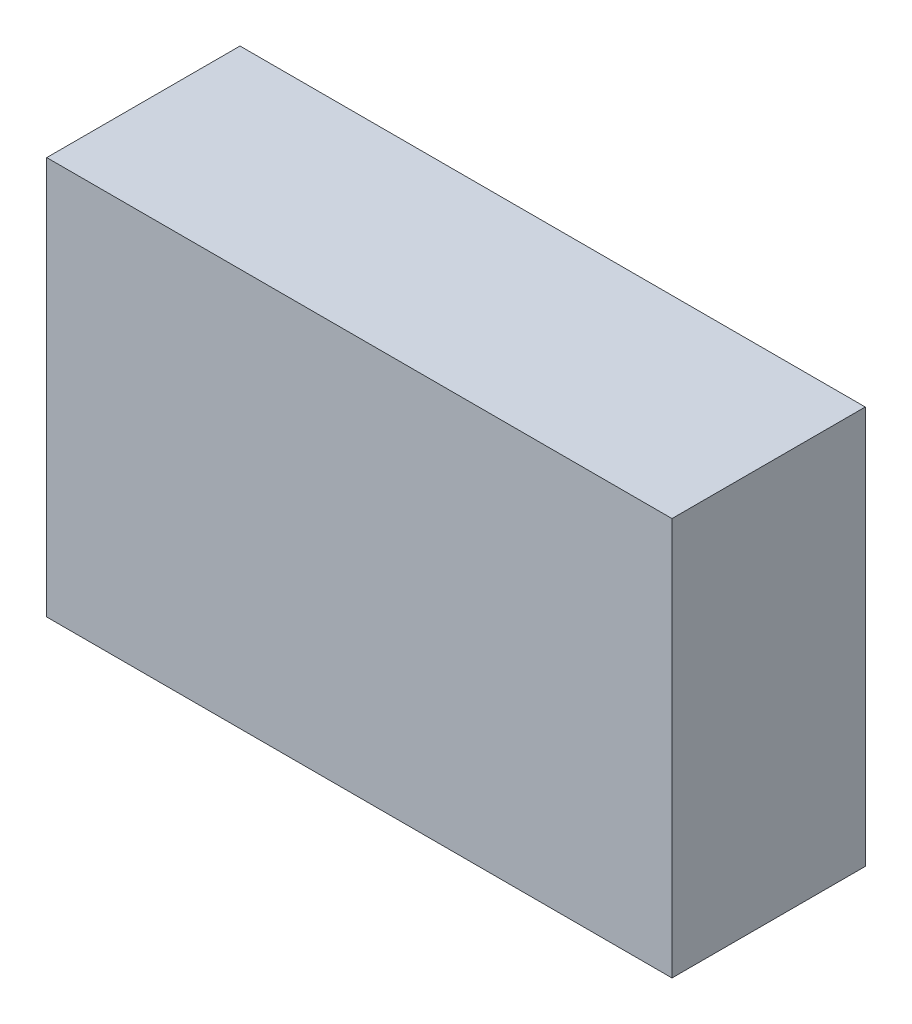
ISO-10303-21;
HEADER;
FILE_DESCRIPTION(('STEP AP214'),'2;1');
FILE_NAME('part.step','',(''),(''),'','','');
FILE_SCHEMA(('AUTOMOTIVE_DESIGN { 1 0 10303 214 1 1 1 1 }'));
ENDSEC;
DATA;
#1=APPLICATION_CONTEXT('core data for automotive mechanical design processes');
#2=APPLICATION_PROTOCOL_DEFINITION('international standard','automotive_design',2000,#1);
#3=PRODUCT_CONTEXT('',#1,'mechanical');
#4=PRODUCT('Part','Part','',(#3));
#5=PRODUCT_RELATED_PRODUCT_CATEGORY('part','',(#4));
#6=PRODUCT_DEFINITION_FORMATION('','',#4);
#7=PRODUCT_DEFINITION_CONTEXT('part definition',#1,'design');
#8=PRODUCT_DEFINITION('design','',#6,#7);
#9=PRODUCT_DEFINITION_SHAPE('','',#8);
#10=(LENGTH_UNIT() NAMED_UNIT(*) SI_UNIT(.MILLI.,.METRE.));
#11=(NAMED_UNIT(*) PLANE_ANGLE_UNIT() SI_UNIT($,.RADIAN.));
#12=(NAMED_UNIT(*) SI_UNIT($,.STERADIAN.) SOLID_ANGLE_UNIT());
#13=UNCERTAINTY_MEASURE_WITH_UNIT(LENGTH_MEASURE(1.E-05),#10,'distance_accuracy_value','');
#14=(GEOMETRIC_REPRESENTATION_CONTEXT(3) GLOBAL_UNCERTAINTY_ASSIGNED_CONTEXT((#13)) GLOBAL_UNIT_ASSIGNED_CONTEXT((#10,
#11,#12)) REPRESENTATION_CONTEXT('',''));
#15=CARTESIAN_POINT('',(0.,0.,0.));
#16=DIRECTION('',(0.,0.,1.));
#17=DIRECTION('',(1.,0.,0.));
#18=AXIS2_PLACEMENT_3D('',#15,#16,#17);
#19=CARTESIAN_POINT('',(-2.74999958,1.74999904,1.69999914));
#20=DIRECTION('',(0.,0.,-1.));
#21=DIRECTION('',(0.,-1.,0.));
#22=AXIS2_PLACEMENT_3D('',#19,#20,#21);
#23=PLANE('',#22);
#24=DIRECTION('',(0.,-1.,0.));
#25=VECTOR('',#24,1.);
#26=CARTESIAN_POINT('',(-2.74999958,1.74999904,1.69999914));
#27=LINE('',#26,#25);
#28=CARTESIAN_POINT('',(-2.74999958,1.74999904,1.69999914));
#29=VERTEX_POINT('',#28);
#30=CARTESIAN_POINT('',(-2.74999958,-1.74999904,1.69999914));
#31=VERTEX_POINT('',#30);
#32=EDGE_CURVE('E82',#29,#31,#27,.T.);
#33=ORIENTED_EDGE('',*,*,#32,.T.);
#34=DIRECTION('',(1.,0.,0.));
#35=VECTOR('',#34,1.);
#36=CARTESIAN_POINT('',(-2.74999958,-1.74999904,1.69999914));
#37=LINE('',#36,#35);
#38=CARTESIAN_POINT('',(2.74999958,-1.74999904,1.69999914));
#39=VERTEX_POINT('',#38);
#40=EDGE_CURVE('E98',#31,#39,#37,.T.);
#41=ORIENTED_EDGE('',*,*,#40,.T.);
#42=DIRECTION('',(0.,1.,0.));
#43=VECTOR('',#42,1.);
#44=CARTESIAN_POINT('',(2.74999958,-1.74999904,1.69999914));
#45=LINE('',#44,#43);
#46=CARTESIAN_POINT('',(2.74999958,1.74999904,1.69999914));
#47=VERTEX_POINT('',#46);
#48=EDGE_CURVE('E74',#39,#47,#45,.T.);
#49=ORIENTED_EDGE('',*,*,#48,.T.);
#50=DIRECTION('',(-1.,0.,0.));
#51=VECTOR('',#50,1.);
#52=CARTESIAN_POINT('',(2.74999958,1.74999904,1.69999914));
#53=LINE('',#52,#51);
#54=EDGE_CURVE('E11',#47,#29,#53,.T.);
#55=ORIENTED_EDGE('',*,*,#54,.T.);
#56=EDGE_LOOP('',(#33,#41,#49,#55));
#57=FACE_BOUND('',#56,.T.);
#58=ADVANCED_FACE('F17',(#57),#23,.F.);
#59=CARTESIAN_POINT('',(-2.74999958,1.74999904,0.));
#60=DIRECTION('',(0.,0.,-1.));
#61=DIRECTION('',(0.,-1.,0.));
#62=AXIS2_PLACEMENT_3D('',#59,#60,#61);
#63=PLANE('',#62);
#64=DIRECTION('',(-1.,0.,0.));
#65=VECTOR('',#64,1.);
#66=CARTESIAN_POINT('',(2.74999958,1.74999904,0.));
#67=LINE('',#66,#65);
#68=CARTESIAN_POINT('',(2.74999958,1.74999904,0.));
#69=VERTEX_POINT('',#68);
#70=CARTESIAN_POINT('',(-2.74999958,1.74999904,0.));
#71=VERTEX_POINT('',#70);
#72=EDGE_CURVE('E26',#69,#71,#67,.T.);
#73=ORIENTED_EDGE('',*,*,#72,.F.);
#74=DIRECTION('',(0.,1.,0.));
#75=VECTOR('',#74,1.);
#76=CARTESIAN_POINT('',(2.74999958,-1.74999904,0.));
#77=LINE('',#76,#75);
#78=CARTESIAN_POINT('',(2.74999958,-1.74999904,0.));
#79=VERTEX_POINT('',#78);
#80=EDGE_CURVE('E101',#79,#69,#77,.T.);
#81=ORIENTED_EDGE('',*,*,#80,.F.);
#82=DIRECTION('',(1.,0.,0.));
#83=VECTOR('',#82,1.);
#84=CARTESIAN_POINT('',(-2.74999958,-1.74999904,0.));
#85=LINE('',#84,#83);
#86=CARTESIAN_POINT('',(-2.74999958,-1.74999904,0.));
#87=VERTEX_POINT('',#86);
#88=EDGE_CURVE('E84',#87,#79,#85,.T.);
#89=ORIENTED_EDGE('',*,*,#88,.F.);
#90=DIRECTION('',(0.,-1.,0.));
#91=VECTOR('',#90,1.);
#92=CARTESIAN_POINT('',(-2.74999958,1.74999904,0.));
#93=LINE('',#92,#91);
#94=EDGE_CURVE('E80',#71,#87,#93,.T.);
#95=ORIENTED_EDGE('',*,*,#94,.F.);
#96=EDGE_LOOP('',(#73,#81,#89,#95));
#97=FACE_BOUND('',#96,.T.);
#98=ADVANCED_FACE('F86',(#97),#63,.T.);
#99=CARTESIAN_POINT('',(2.74999958,1.74999904,0.));
#100=DIRECTION('',(0.,-1.,0.));
#101=DIRECTION('',(0.,0.,-1.));
#102=AXIS2_PLACEMENT_3D('',#99,#100,#101);
#103=PLANE('',#102);
#104=ORIENTED_EDGE('',*,*,#72,.T.);
#105=DIRECTION('',(0.,0.,1.));
#106=VECTOR('',#105,1.);
#107=CARTESIAN_POINT('',(-2.74999958,1.74999904,0.));
#108=LINE('',#107,#106);
#109=EDGE_CURVE('E68',#71,#29,#108,.T.);
#110=ORIENTED_EDGE('',*,*,#109,.T.);
#111=ORIENTED_EDGE('',*,*,#54,.F.);
#112=DIRECTION('',(0.,0.,1.));
#113=VECTOR('',#112,1.);
#114=CARTESIAN_POINT('',(2.74999958,1.74999904,0.));
#115=LINE('',#114,#113);
#116=EDGE_CURVE('E71',#69,#47,#115,.T.);
#117=ORIENTED_EDGE('',*,*,#116,.F.);
#118=EDGE_LOOP('',(#104,#110,#111,#117));
#119=FACE_BOUND('',#118,.T.);
#120=ADVANCED_FACE('F19',(#119),#103,.F.);
#121=CARTESIAN_POINT('',(2.74999958,-1.74999904,0.));
#122=DIRECTION('',(-1.,0.,0.));
#123=DIRECTION('',(0.,0.,1.));
#124=AXIS2_PLACEMENT_3D('',#121,#122,#123);
#125=PLANE('',#124);
#126=ORIENTED_EDGE('',*,*,#80,.T.);
#127=ORIENTED_EDGE('',*,*,#116,.T.);
#128=ORIENTED_EDGE('',*,*,#48,.F.);
#129=DIRECTION('',(0.,0.,1.));
#130=VECTOR('',#129,1.);
#131=CARTESIAN_POINT('',(2.74999958,-1.74999904,0.));
#132=LINE('',#131,#130);
#133=EDGE_CURVE('E102',#79,#39,#132,.T.);
#134=ORIENTED_EDGE('',*,*,#133,.F.);
#135=EDGE_LOOP('',(#126,#127,#128,#134));
#136=FACE_BOUND('',#135,.T.);
#137=ADVANCED_FACE('F120',(#136),#125,.F.);
#138=CARTESIAN_POINT('',(-2.74999958,-1.74999904,0.));
#139=DIRECTION('',(0.,1.,0.));
#140=DIRECTION('',(1.,0.,0.));
#141=AXIS2_PLACEMENT_3D('',#138,#139,#140);
#142=PLANE('',#141);
#143=ORIENTED_EDGE('',*,*,#88,.T.);
#144=ORIENTED_EDGE('',*,*,#133,.T.);
#145=ORIENTED_EDGE('',*,*,#40,.F.);
#146=DIRECTION('',(0.,0.,1.));
#147=VECTOR('',#146,1.);
#148=CARTESIAN_POINT('',(-2.74999958,-1.74999904,0.));
#149=LINE('',#148,#147);
#150=EDGE_CURVE('E90',#87,#31,#149,.T.);
#151=ORIENTED_EDGE('',*,*,#150,.F.);
#152=EDGE_LOOP('',(#143,#144,#145,#151));
#153=FACE_BOUND('',#152,.T.);
#154=ADVANCED_FACE('F122',(#153),#142,.F.);
#155=CARTESIAN_POINT('',(-2.74999958,1.74999904,0.));
#156=DIRECTION('',(1.,0.,0.));
#157=DIRECTION('',(0.,1.,0.));
#158=AXIS2_PLACEMENT_3D('',#155,#156,#157);
#159=PLANE('',#158);
#160=ORIENTED_EDGE('',*,*,#94,.T.);
#161=ORIENTED_EDGE('',*,*,#150,.T.);
#162=ORIENTED_EDGE('',*,*,#32,.F.);
#163=ORIENTED_EDGE('',*,*,#109,.F.);
#164=EDGE_LOOP('',(#160,#161,#162,#163));
#165=FACE_BOUND('',#164,.T.);
#166=ADVANCED_FACE('F78',(#165),#159,.F.);
#167=CLOSED_SHELL('',(#58,#98,#120,#137,#154,#166));
#168=MANIFOLD_SOLID_BREP('B1',#167);
#169=ADVANCED_BREP_SHAPE_REPRESENTATION('',(#18,#168),#14);
#170=SHAPE_DEFINITION_REPRESENTATION(#9,#169);
ENDSEC;
END-ISO-10303-21;
